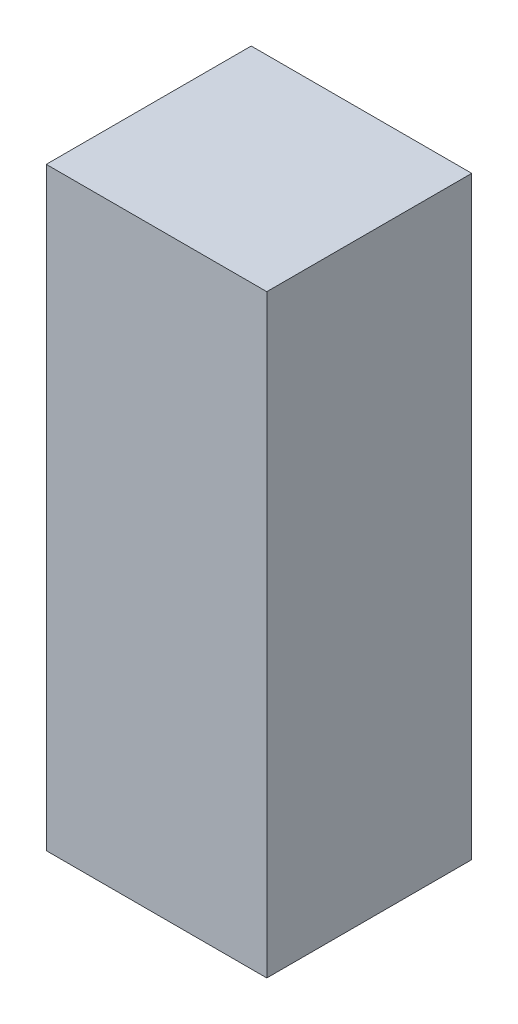
ISO-10303-21;
HEADER;
FILE_DESCRIPTION(('STEP AP214'),'2;1');
FILE_NAME('part.step','',(''),(''),'','','');
FILE_SCHEMA(('AUTOMOTIVE_DESIGN { 1 0 10303 214 1 1 1 1 }'));
ENDSEC;
DATA;
#1=APPLICATION_CONTEXT('core data for automotive mechanical design processes');
#2=APPLICATION_PROTOCOL_DEFINITION('international standard','automotive_design',2000,#1);
#3=PRODUCT_CONTEXT('',#1,'mechanical');
#4=PRODUCT('Part','Part','',(#3));
#5=PRODUCT_RELATED_PRODUCT_CATEGORY('part','',(#4));
#6=PRODUCT_DEFINITION_FORMATION('','',#4);
#7=PRODUCT_DEFINITION_CONTEXT('part definition',#1,'design');
#8=PRODUCT_DEFINITION('design','',#6,#7);
#9=PRODUCT_DEFINITION_SHAPE('','',#8);
#10=(LENGTH_UNIT() NAMED_UNIT(*) SI_UNIT(.MILLI.,.METRE.));
#11=(NAMED_UNIT(*) PLANE_ANGLE_UNIT() SI_UNIT($,.RADIAN.));
#12=(NAMED_UNIT(*) SI_UNIT($,.STERADIAN.) SOLID_ANGLE_UNIT());
#13=UNCERTAINTY_MEASURE_WITH_UNIT(LENGTH_MEASURE(1.E-05),#10,'distance_accuracy_value','');
#14=(GEOMETRIC_REPRESENTATION_CONTEXT(3) GLOBAL_UNCERTAINTY_ASSIGNED_CONTEXT((#13)) GLOBAL_UNIT_ASSIGNED_CONTEXT((#10,
#11,#12)) REPRESENTATION_CONTEXT('',''));
#15=CARTESIAN_POINT('',(0.,0.,0.));
#16=DIRECTION('',(0.,0.,1.));
#17=DIRECTION('',(1.,0.,0.));
#18=AXIS2_PLACEMENT_3D('',#15,#16,#17);
#19=CARTESIAN_POINT('',(1.834,-0.725,0.5));
#20=DIRECTION('',(0.,0.,1.));
#21=DIRECTION('',(1.,0.,0.));
#22=AXIS2_PLACEMENT_3D('',#19,#20,#21);
#23=PLANE('',#22);
#24=DIRECTION('',(1.,0.,0.));
#25=VECTOR('',#24,1.);
#26=CARTESIAN_POINT('',(1.834,0.725,0.5));
#27=LINE('',#26,#25);
#28=CARTESIAN_POINT('',(1.834,0.725,0.5));
#29=VERTEX_POINT('',#28);
#30=CARTESIAN_POINT('',(2.372,0.725,0.5));
#31=VERTEX_POINT('',#30);
#32=EDGE_CURVE('E53',#29,#31,#27,.T.);
#33=ORIENTED_EDGE('',*,*,#32,.F.);
#34=DIRECTION('',(0.,1.,0.));
#35=VECTOR('',#34,1.);
#36=CARTESIAN_POINT('',(1.834,-0.725,0.5));
#37=LINE('',#36,#35);
#38=CARTESIAN_POINT('',(1.834,-0.725,0.5));
#39=VERTEX_POINT('',#38);
#40=EDGE_CURVE('E68',#39,#29,#37,.T.);
#41=ORIENTED_EDGE('',*,*,#40,.F.);
#42=DIRECTION('',(1.,0.,0.));
#43=VECTOR('',#42,1.);
#44=CARTESIAN_POINT('',(2.372,-0.725,0.5));
#45=LINE('',#44,#43);
#46=CARTESIAN_POINT('',(2.372,-0.725,0.5));
#47=VERTEX_POINT('',#46);
#48=EDGE_CURVE('E20',#47,#39,#45,.F.);
#49=ORIENTED_EDGE('',*,*,#48,.F.);
#50=DIRECTION('',(0.,1.,0.));
#51=VECTOR('',#50,1.);
#52=CARTESIAN_POINT('',(2.372,0.725,0.5));
#53=LINE('',#52,#51);
#54=EDGE_CURVE('E58',#31,#47,#53,.F.);
#55=ORIENTED_EDGE('',*,*,#54,.F.);
#56=EDGE_LOOP('',(#33,#41,#49,#55));
#57=FACE_BOUND('',#56,.T.);
#58=ADVANCED_FACE('F17',(#57),#23,.T.);
#59=CARTESIAN_POINT('',(2.372,-0.725,0.));
#60=DIRECTION('',(0.,-1.,0.));
#61=DIRECTION('',(0.,0.,-1.));
#62=AXIS2_PLACEMENT_3D('',#59,#60,#61);
#63=PLANE('',#62);
#64=DIRECTION('',(0.,0.,1.));
#65=VECTOR('',#64,1.);
#66=CARTESIAN_POINT('',(1.834,-0.725,0.));
#67=LINE('',#66,#65);
#68=CARTESIAN_POINT('',(1.834,-0.725,0.));
#69=VERTEX_POINT('',#68);
#70=EDGE_CURVE('E79',#69,#39,#67,.T.);
#71=ORIENTED_EDGE('',*,*,#70,.F.);
#72=DIRECTION('',(1.,0.,0.));
#73=VECTOR('',#72,1.);
#74=CARTESIAN_POINT('',(1.834,-0.725,0.));
#75=LINE('',#74,#73);
#76=CARTESIAN_POINT('',(2.372,-0.725,0.));
#77=VERTEX_POINT('',#76);
#78=EDGE_CURVE('E74',#69,#77,#75,.T.);
#79=ORIENTED_EDGE('',*,*,#78,.T.);
#80=DIRECTION('',(0.,0.,-1.));
#81=VECTOR('',#80,1.);
#82=CARTESIAN_POINT('',(2.372,-0.725,0.));
#83=LINE('',#82,#81);
#84=EDGE_CURVE('E63',#47,#77,#83,.T.);
#85=ORIENTED_EDGE('',*,*,#84,.F.);
#86=ORIENTED_EDGE('',*,*,#48,.T.);
#87=EDGE_LOOP('',(#71,#79,#85,#86));
#88=FACE_BOUND('',#87,.T.);
#89=ADVANCED_FACE('F73',(#88),#63,.T.);
#90=CARTESIAN_POINT('',(2.372,0.725,0.));
#91=DIRECTION('',(1.,0.,0.));
#92=DIRECTION('',(0.,0.,-1.));
#93=AXIS2_PLACEMENT_3D('',#90,#91,#92);
#94=PLANE('',#93);
#95=ORIENTED_EDGE('',*,*,#84,.T.);
#96=DIRECTION('',(0.,1.,0.));
#97=VECTOR('',#96,1.);
#98=CARTESIAN_POINT('',(2.372,-0.725,0.));
#99=LINE('',#98,#97);
#100=CARTESIAN_POINT('',(2.372,0.725,0.));
#101=VERTEX_POINT('',#100);
#102=EDGE_CURVE('E84',#77,#101,#99,.T.);
#103=ORIENTED_EDGE('',*,*,#102,.T.);
#104=DIRECTION('',(0.,0.,1.));
#105=VECTOR('',#104,1.);
#106=CARTESIAN_POINT('',(2.372,0.725,0.));
#107=LINE('',#106,#105);
#108=EDGE_CURVE('E65',#31,#101,#107,.F.);
#109=ORIENTED_EDGE('',*,*,#108,.F.);
#110=ORIENTED_EDGE('',*,*,#54,.T.);
#111=EDGE_LOOP('',(#95,#103,#109,#110));
#112=FACE_BOUND('',#111,.T.);
#113=ADVANCED_FACE('F60',(#112),#94,.T.);
#114=CARTESIAN_POINT('',(1.834,0.725,0.));
#115=DIRECTION('',(0.,1.,0.));
#116=DIRECTION('',(0.,0.,1.));
#117=AXIS2_PLACEMENT_3D('',#114,#115,#116);
#118=PLANE('',#117);
#119=ORIENTED_EDGE('',*,*,#108,.T.);
#120=DIRECTION('',(1.,0.,0.));
#121=VECTOR('',#120,1.);
#122=CARTESIAN_POINT('',(1.834,0.725,0.));
#123=LINE('',#122,#121);
#124=CARTESIAN_POINT('',(1.834,0.725,0.));
#125=VERTEX_POINT('',#124);
#126=EDGE_CURVE('E26',#101,#125,#123,.F.);
#127=ORIENTED_EDGE('',*,*,#126,.T.);
#128=DIRECTION('',(0.,0.,1.));
#129=VECTOR('',#128,1.);
#130=CARTESIAN_POINT('',(1.834,0.725,0.));
#131=LINE('',#130,#129);
#132=EDGE_CURVE('E34',#29,#125,#131,.F.);
#133=ORIENTED_EDGE('',*,*,#132,.F.);
#134=ORIENTED_EDGE('',*,*,#32,.T.);
#135=EDGE_LOOP('',(#119,#127,#133,#134));
#136=FACE_BOUND('',#135,.T.);
#137=ADVANCED_FACE('F88',(#136),#118,.T.);
#138=CARTESIAN_POINT('',(1.834,-0.725,0.));
#139=DIRECTION('',(-1.,0.,0.));
#140=DIRECTION('',(0.,0.,1.));
#141=AXIS2_PLACEMENT_3D('',#138,#139,#140);
#142=PLANE('',#141);
#143=ORIENTED_EDGE('',*,*,#132,.T.);
#144=DIRECTION('',(0.,1.,0.));
#145=VECTOR('',#144,1.);
#146=CARTESIAN_POINT('',(1.834,-0.725,0.));
#147=LINE('',#146,#145);
#148=EDGE_CURVE('E11',#125,#69,#147,.F.);
#149=ORIENTED_EDGE('',*,*,#148,.T.);
#150=ORIENTED_EDGE('',*,*,#70,.T.);
#151=ORIENTED_EDGE('',*,*,#40,.T.);
#152=EDGE_LOOP('',(#143,#149,#150,#151));
#153=FACE_BOUND('',#152,.T.);
#154=ADVANCED_FACE('F91',(#153),#142,.T.);
#155=CARTESIAN_POINT('',(1.834,-0.725,0.));
#156=DIRECTION('',(0.,0.,1.));
#157=DIRECTION('',(1.,0.,0.));
#158=AXIS2_PLACEMENT_3D('',#155,#156,#157);
#159=PLANE('',#158);
#160=ORIENTED_EDGE('',*,*,#126,.F.);
#161=ORIENTED_EDGE('',*,*,#102,.F.);
#162=ORIENTED_EDGE('',*,*,#78,.F.);
#163=ORIENTED_EDGE('',*,*,#148,.F.);
#164=EDGE_LOOP('',(#160,#161,#162,#163));
#165=FACE_BOUND('',#164,.T.);
#166=ADVANCED_FACE('F90',(#165),#159,.F.);
#167=CLOSED_SHELL('',(#58,#89,#113,#137,#154,#166));
#168=MANIFOLD_SOLID_BREP('B1',#167);
#169=ADVANCED_BREP_SHAPE_REPRESENTATION('',(#18,#168),#14);
#170=SHAPE_DEFINITION_REPRESENTATION(#9,#169);
ENDSEC;
END-ISO-10303-21;
